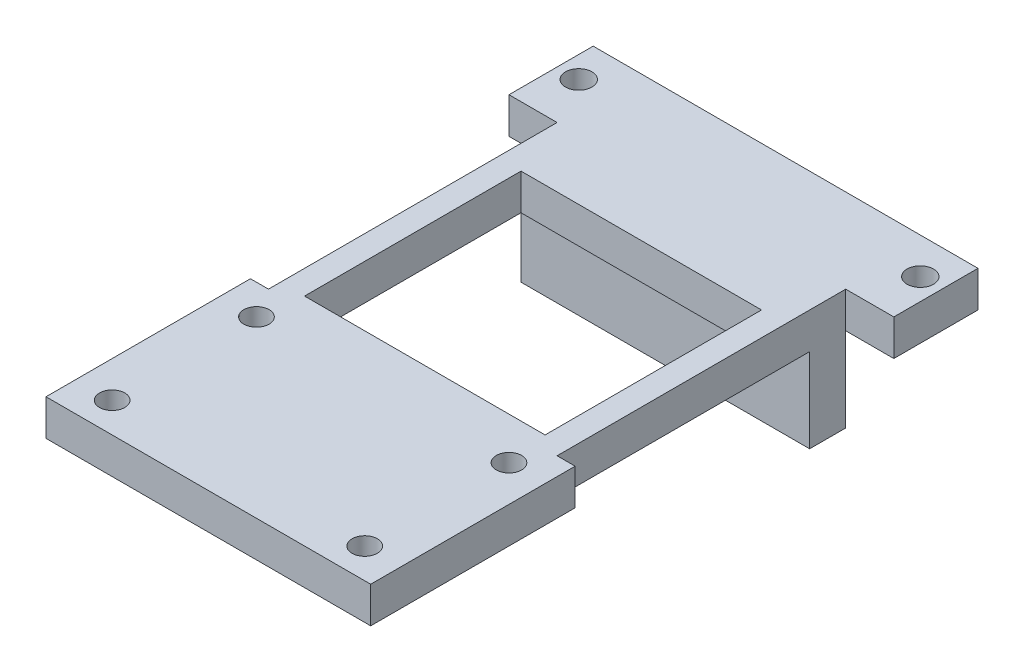
ISO-10303-21;
HEADER;
FILE_DESCRIPTION(('STEP AP214'),'2;1');
FILE_NAME('part.step','',(''),(''),'','','');
FILE_SCHEMA(('AUTOMOTIVE_DESIGN { 1 0 10303 214 1 1 1 1 }'));
ENDSEC;
DATA;
#1=APPLICATION_CONTEXT('core data for automotive mechanical design processes');
#2=APPLICATION_PROTOCOL_DEFINITION('international standard','automotive_design',2000,#1);
#3=PRODUCT_CONTEXT('',#1,'mechanical');
#4=PRODUCT('Part','Part','',(#3));
#5=PRODUCT_RELATED_PRODUCT_CATEGORY('part','',(#4));
#6=PRODUCT_DEFINITION_FORMATION('','',#4);
#7=PRODUCT_DEFINITION_CONTEXT('part definition',#1,'design');
#8=PRODUCT_DEFINITION('design','',#6,#7);
#9=PRODUCT_DEFINITION_SHAPE('','',#8);
#10=(LENGTH_UNIT() NAMED_UNIT(*) SI_UNIT(.MILLI.,.METRE.));
#11=(NAMED_UNIT(*) PLANE_ANGLE_UNIT() SI_UNIT($,.RADIAN.));
#12=(NAMED_UNIT(*) SI_UNIT($,.STERADIAN.) SOLID_ANGLE_UNIT());
#13=UNCERTAINTY_MEASURE_WITH_UNIT(LENGTH_MEASURE(1.E-05),#10,'distance_accuracy_value','');
#14=(GEOMETRIC_REPRESENTATION_CONTEXT(3) GLOBAL_UNCERTAINTY_ASSIGNED_CONTEXT((#13)) GLOBAL_UNIT_ASSIGNED_CONTEXT((#10,
#11,#12)) REPRESENTATION_CONTEXT('',''));
#15=CARTESIAN_POINT('',(0.,0.,0.));
#16=DIRECTION('',(0.,0.,1.));
#17=DIRECTION('',(1.,0.,0.));
#18=AXIS2_PLACEMENT_3D('',#15,#16,#17);
#19=CARTESIAN_POINT('',(22.,7.,-2.99999999999999));
#20=DIRECTION('',(0.,0.,-1.));
#21=DIRECTION('',(-1.,0.,0.));
#22=AXIS2_PLACEMENT_3D('',#19,#20,#21);
#23=PLANE('',#22);
#24=DIRECTION('',(0.,1.,0.));
#25=VECTOR('',#24,1.);
#26=CARTESIAN_POINT('',(-2.,7.,-2.99999999999999));
#27=LINE('',#26,#25);
#28=CARTESIAN_POINT('',(-2.,0.,-2.99999999999999));
#29=VERTEX_POINT('',#28);
#30=CARTESIAN_POINT('',(-2.,7.,-2.99999999999999));
#31=VERTEX_POINT('',#30);
#32=EDGE_CURVE('E277',#29,#31,#27,.T.);
#33=ORIENTED_EDGE('',*,*,#32,.T.);
#34=DIRECTION('',(1.,0.,0.));
#35=VECTOR('',#34,1.);
#36=CARTESIAN_POINT('',(-6.,7.,-2.99999999999999));
#37=LINE('',#36,#35);
#38=CARTESIAN_POINT('',(22.,7.,-2.99999999999999));
#39=VERTEX_POINT('',#38);
#40=EDGE_CURVE('E11',#31,#39,#37,.T.);
#41=ORIENTED_EDGE('',*,*,#40,.T.);
#42=DIRECTION('',(0.,1.,0.));
#43=VECTOR('',#42,1.);
#44=CARTESIAN_POINT('',(22.,7.,-2.99999999999999));
#45=LINE('',#44,#43);
#46=CARTESIAN_POINT('',(22.,0.,-2.99999999999999));
#47=VERTEX_POINT('',#46);
#48=EDGE_CURVE('E281',#47,#39,#45,.T.);
#49=ORIENTED_EDGE('',*,*,#48,.F.);
#50=DIRECTION('',(1.,0.,0.));
#51=VECTOR('',#50,1.);
#52=CARTESIAN_POINT('',(-2.,0.,-2.99999999999999));
#53=LINE('',#52,#51);
#54=EDGE_CURVE('E247',#29,#47,#53,.T.);
#55=ORIENTED_EDGE('',*,*,#54,.F.);
#56=EDGE_LOOP('',(#33,#41,#49,#55));
#57=FACE_BOUND('',#56,.T.);
#58=ADVANCED_FACE('F35',(#57),#23,.T.);
#59=CARTESIAN_POINT('',(0.,7.,21.));
#60=DIRECTION('',(0.,1.,0.));
#61=DIRECTION('',(0.,0.,1.));
#62=AXIS2_PLACEMENT_3D('',#59,#60,#61);
#63=PLANE('',#62);
#64=DIRECTION('',(1.,0.,0.));
#65=VECTOR('',#64,1.);
#66=CARTESIAN_POINT('',(0.,7.,20.));
#67=LINE('',#66,#65);
#68=CARTESIAN_POINT('',(0.,7.,20.));
#69=VERTEX_POINT('',#68);
#70=CARTESIAN_POINT('',(20.,7.,20.));
#71=VERTEX_POINT('',#70);
#72=EDGE_CURVE('E237',#69,#71,#67,.T.);
#73=ORIENTED_EDGE('',*,*,#72,.T.);
#74=DIRECTION('',(0.,0.,-1.));
#75=VECTOR('',#74,1.);
#76=CARTESIAN_POINT('',(20.,7.,21.));
#77=LINE('',#76,#75);
#78=CARTESIAN_POINT('',(20.,7.,2.00000000000001));
#79=VERTEX_POINT('',#78);
#80=EDGE_CURVE('E240',#71,#79,#77,.T.);
#81=ORIENTED_EDGE('',*,*,#80,.T.);
#82=DIRECTION('',(-1.,0.,0.));
#83=VECTOR('',#82,1.);
#84=CARTESIAN_POINT('',(0.,7.,2.00000000000001));
#85=LINE('',#84,#83);
#86=CARTESIAN_POINT('',(0.,7.,2.00000000000001));
#87=VERTEX_POINT('',#86);
#88=EDGE_CURVE('E226',#79,#87,#85,.T.);
#89=ORIENTED_EDGE('',*,*,#88,.T.);
#90=DIRECTION('',(0.,0.,1.));
#91=VECTOR('',#90,1.);
#92=CARTESIAN_POINT('',(0.,7.,21.));
#93=LINE('',#92,#91);
#94=EDGE_CURVE('E234',#87,#69,#93,.T.);
#95=ORIENTED_EDGE('',*,*,#94,.T.);
#96=EDGE_LOOP('',(#73,#81,#89,#95));
#97=FACE_BOUND('',#96,.T.);
#98=CARTESIAN_POINT('',(-0.5,7.,23.5));
#99=DIRECTION('',(0.,-1.,0.));
#100=DIRECTION('',(0.,0.,-1.));
#101=AXIS2_PLACEMENT_3D('',#98,#99,#100);
#102=CIRCLE('',#101,1.05);
#103=CARTESIAN_POINT('',(-0.5,7.,22.45));
#104=VERTEX_POINT('',#103);
#105=EDGE_CURVE('E290',#104,#104,#102,.T.);
#106=ORIENTED_EDGE('',*,*,#105,.F.);
#107=EDGE_LOOP('',(#106));
#108=FACE_BOUND('',#107,.T.);
#109=CARTESIAN_POINT('',(20.5,7.,23.5));
#110=DIRECTION('',(0.,-1.,0.));
#111=DIRECTION('',(0.,0.,-1.));
#112=AXIS2_PLACEMENT_3D('',#109,#110,#111);
#113=CIRCLE('',#112,1.05);
#114=CARTESIAN_POINT('',(20.5,7.,22.45));
#115=VERTEX_POINT('',#114);
#116=EDGE_CURVE('E287',#115,#115,#113,.T.);
#117=ORIENTED_EDGE('',*,*,#116,.F.);
#118=EDGE_LOOP('',(#117));
#119=FACE_BOUND('',#118,.T.);
#120=CARTESIAN_POINT('',(20.5,7.,35.5));
#121=DIRECTION('',(0.,-1.,0.));
#122=DIRECTION('',(0.,0.,-1.));
#123=AXIS2_PLACEMENT_3D('',#120,#121,#122);
#124=CIRCLE('',#123,1.05);
#125=CARTESIAN_POINT('',(20.5,7.,34.45));
#126=VERTEX_POINT('',#125);
#127=EDGE_CURVE('E291',#126,#126,#124,.T.);
#128=ORIENTED_EDGE('',*,*,#127,.F.);
#129=EDGE_LOOP('',(#128));
#130=FACE_BOUND('',#129,.T.);
#131=CARTESIAN_POINT('',(-0.5,7.,35.5));
#132=DIRECTION('',(0.,-1.,0.));
#133=DIRECTION('',(0.,0.,-1.));
#134=AXIS2_PLACEMENT_3D('',#131,#132,#133);
#135=CIRCLE('',#134,1.05);
#136=CARTESIAN_POINT('',(-0.5,7.,34.45));
#137=VERTEX_POINT('',#136);
#138=EDGE_CURVE('E276',#137,#137,#135,.T.);
#139=ORIENTED_EDGE('',*,*,#138,.F.);
#140=EDGE_LOOP('',(#139));
#141=FACE_BOUND('',#140,.T.);
#142=DIRECTION('',(-1.,0.,0.));
#143=VECTOR('',#142,1.);
#144=CARTESIAN_POINT('',(-2.,7.,0.));
#145=LINE('',#144,#143);
#146=CARTESIAN_POINT('',(22.,7.,0.));
#147=VERTEX_POINT('',#146);
#148=CARTESIAN_POINT('',(-2.,7.,0.));
#149=VERTEX_POINT('',#148);
#150=EDGE_CURVE('E243',#147,#149,#145,.T.);
#151=ORIENTED_EDGE('',*,*,#150,.F.);
#152=DIRECTION('',(0.,0.,-1.));
#153=VECTOR('',#152,1.);
#154=CARTESIAN_POINT('',(22.,7.,21.));
#155=LINE('',#154,#153);
#156=CARTESIAN_POINT('',(22.,7.,21.));
#157=VERTEX_POINT('',#156);
#158=EDGE_CURVE('E263',#157,#147,#155,.T.);
#159=ORIENTED_EDGE('',*,*,#158,.F.);
#160=DIRECTION('',(1.,0.,0.));
#161=VECTOR('',#160,1.);
#162=CARTESIAN_POINT('',(0.,7.,21.));
#163=LINE('',#162,#161);
#164=CARTESIAN_POINT('',(23.5,7.,21.));
#165=VERTEX_POINT('',#164);
#166=EDGE_CURVE('E333',#157,#165,#163,.T.);
#167=ORIENTED_EDGE('',*,*,#166,.T.);
#168=DIRECTION('',(0.,0.,1.));
#169=VECTOR('',#168,1.);
#170=CARTESIAN_POINT('',(23.5,7.,38.));
#171=LINE('',#170,#169);
#172=CARTESIAN_POINT('',(23.5,7.,38.));
#173=VERTEX_POINT('',#172);
#174=EDGE_CURVE('E310',#165,#173,#171,.T.);
#175=ORIENTED_EDGE('',*,*,#174,.T.);
#176=DIRECTION('',(-1.,0.,0.));
#177=VECTOR('',#176,1.);
#178=CARTESIAN_POINT('',(-3.5,7.,38.));
#179=LINE('',#178,#177);
#180=CARTESIAN_POINT('',(-3.5,7.,38.));
#181=VERTEX_POINT('',#180);
#182=EDGE_CURVE('E327',#173,#181,#179,.T.);
#183=ORIENTED_EDGE('',*,*,#182,.T.);
#184=DIRECTION('',(0.,0.,-1.));
#185=VECTOR('',#184,1.);
#186=CARTESIAN_POINT('',(-3.5,7.,21.));
#187=LINE('',#186,#185);
#188=CARTESIAN_POINT('',(-3.5,7.,21.));
#189=VERTEX_POINT('',#188);
#190=EDGE_CURVE('E330',#181,#189,#187,.T.);
#191=ORIENTED_EDGE('',*,*,#190,.T.);
#192=CARTESIAN_POINT('',(-2.,7.,21.));
#193=VERTEX_POINT('',#192);
#194=EDGE_CURVE('E334',#189,#193,#163,.T.);
#195=ORIENTED_EDGE('',*,*,#194,.T.);
#196=DIRECTION('',(0.,0.,1.));
#197=VECTOR('',#196,1.);
#198=CARTESIAN_POINT('',(-2.,7.,-2.99999999999999));
#199=LINE('',#198,#197);
#200=EDGE_CURVE('E266',#149,#193,#199,.T.);
#201=ORIENTED_EDGE('',*,*,#200,.F.);
#202=EDGE_LOOP('',(#151,#159,#167,#175,#183,#191,#195,#201));
#203=FACE_BOUND('',#202,.T.);
#204=ADVANCED_FACE('F391',(#97,#108,#119,#130,#141,#203),#63,.F.);
#205=CARTESIAN_POINT('',(0.,10.,21.));
#206=DIRECTION('',(0.,0.,-1.));
#207=DIRECTION('',(-1.,0.,0.));
#208=AXIS2_PLACEMENT_3D('',#205,#206,#207);
#209=PLANE('',#208);
#210=ORIENTED_EDGE('',*,*,#166,.F.);
#211=DIRECTION('',(0.,1.,0.));
#212=VECTOR('',#211,1.);
#213=CARTESIAN_POINT('',(22.,7.,21.));
#214=LINE('',#213,#212);
#215=CARTESIAN_POINT('',(22.,10.,21.));
#216=VERTEX_POINT('',#215);
#217=EDGE_CURVE('E269',#157,#216,#214,.T.);
#218=ORIENTED_EDGE('',*,*,#217,.T.);
#219=DIRECTION('',(1.,0.,0.));
#220=VECTOR('',#219,1.);
#221=CARTESIAN_POINT('',(23.5,10.,21.));
#222=LINE('',#221,#220);
#223=CARTESIAN_POINT('',(23.5,10.,21.));
#224=VERTEX_POINT('',#223);
#225=EDGE_CURVE('E315',#216,#224,#222,.T.);
#226=ORIENTED_EDGE('',*,*,#225,.T.);
#227=DIRECTION('',(0.,-1.,0.));
#228=VECTOR('',#227,1.);
#229=CARTESIAN_POINT('',(23.5,10.,21.));
#230=LINE('',#229,#228);
#231=EDGE_CURVE('E324',#224,#165,#230,.T.);
#232=ORIENTED_EDGE('',*,*,#231,.T.);
#233=EDGE_LOOP('',(#210,#218,#226,#232));
#234=FACE_BOUND('',#233,.T.);
#235=ADVANCED_FACE('F360',(#234),#209,.T.);
#236=CARTESIAN_POINT('',(0.,10.,3.));
#237=DIRECTION('',(0.,-1.,0.));
#238=DIRECTION('',(0.,0.,-1.));
#239=AXIS2_PLACEMENT_3D('',#236,#237,#238);
#240=PLANE('',#239);
#241=CARTESIAN_POINT('',(-4.2,10.,-6.99999999999999));
#242=DIRECTION('',(0.,1.,0.));
#243=DIRECTION('',(0.,0.,1.));
#244=AXIS2_PLACEMENT_3D('',#241,#242,#243);
#245=CIRCLE('',#244,1.1);
#246=CARTESIAN_POINT('',(-4.2,10.,-5.9));
#247=VERTEX_POINT('',#246);
#248=EDGE_CURVE('E345',#247,#247,#245,.T.);
#249=ORIENTED_EDGE('',*,*,#248,.F.);
#250=EDGE_LOOP('',(#249));
#251=FACE_BOUND('',#250,.T.);
#252=CARTESIAN_POINT('',(24.2,10.,-6.99999999999999));
#253=DIRECTION('',(0.,1.,0.));
#254=DIRECTION('',(0.,0.,1.));
#255=AXIS2_PLACEMENT_3D('',#252,#253,#254);
#256=CIRCLE('',#255,1.1);
#257=CARTESIAN_POINT('',(24.2,10.,-5.9));
#258=VERTEX_POINT('',#257);
#259=EDGE_CURVE('E196',#258,#258,#256,.T.);
#260=ORIENTED_EDGE('',*,*,#259,.F.);
#261=EDGE_LOOP('',(#260));
#262=FACE_BOUND('',#261,.T.);
#263=DIRECTION('',(-1.,0.,0.));
#264=VECTOR('',#263,1.);
#265=CARTESIAN_POINT('',(20.,10.,2.00000000000001));
#266=LINE('',#265,#264);
#267=CARTESIAN_POINT('',(20.,10.,2.00000000000001));
#268=VERTEX_POINT('',#267);
#269=CARTESIAN_POINT('',(0.,10.,2.00000000000001));
#270=VERTEX_POINT('',#269);
#271=EDGE_CURVE('E215',#268,#270,#266,.T.);
#272=ORIENTED_EDGE('',*,*,#271,.F.);
#273=DIRECTION('',(0.,0.,-1.));
#274=VECTOR('',#273,1.);
#275=CARTESIAN_POINT('',(20.,10.,20.));
#276=LINE('',#275,#274);
#277=CARTESIAN_POINT('',(20.,10.,20.));
#278=VERTEX_POINT('',#277);
#279=EDGE_CURVE('E209',#278,#268,#276,.T.);
#280=ORIENTED_EDGE('',*,*,#279,.F.);
#281=DIRECTION('',(1.,0.,0.));
#282=VECTOR('',#281,1.);
#283=CARTESIAN_POINT('',(20.,10.,20.));
#284=LINE('',#283,#282);
#285=CARTESIAN_POINT('',(0.,10.,20.));
#286=VERTEX_POINT('',#285);
#287=EDGE_CURVE('E220',#286,#278,#284,.T.);
#288=ORIENTED_EDGE('',*,*,#287,.F.);
#289=DIRECTION('',(0.,0.,1.));
#290=VECTOR('',#289,1.);
#291=CARTESIAN_POINT('',(0.,10.,20.));
#292=LINE('',#291,#290);
#293=EDGE_CURVE('E217',#270,#286,#292,.T.);
#294=ORIENTED_EDGE('',*,*,#293,.F.);
#295=EDGE_LOOP('',(#272,#280,#288,#294));
#296=FACE_BOUND('',#295,.T.);
#297=CARTESIAN_POINT('',(-0.5,10.,35.5));
#298=DIRECTION('',(0.,-1.,0.));
#299=DIRECTION('',(0.,0.,-1.));
#300=AXIS2_PLACEMENT_3D('',#297,#298,#299);
#301=CIRCLE('',#300,1.05);
#302=CARTESIAN_POINT('',(-0.5,10.,34.45));
#303=VERTEX_POINT('',#302);
#304=EDGE_CURVE('E307',#303,#303,#301,.T.);
#305=ORIENTED_EDGE('',*,*,#304,.T.);
#306=EDGE_LOOP('',(#305));
#307=FACE_BOUND('',#306,.T.);
#308=CARTESIAN_POINT('',(20.5,10.,35.5));
#309=DIRECTION('',(0.,-1.,0.));
#310=DIRECTION('',(0.,0.,-1.));
#311=AXIS2_PLACEMENT_3D('',#308,#309,#310);
#312=CIRCLE('',#311,1.05);
#313=CARTESIAN_POINT('',(20.5,10.,34.45));
#314=VERTEX_POINT('',#313);
#315=EDGE_CURVE('E304',#314,#314,#312,.T.);
#316=ORIENTED_EDGE('',*,*,#315,.T.);
#317=EDGE_LOOP('',(#316));
#318=FACE_BOUND('',#317,.T.);
#319=CARTESIAN_POINT('',(20.5,10.,23.5));
#320=DIRECTION('',(0.,-1.,0.));
#321=DIRECTION('',(0.,0.,-1.));
#322=AXIS2_PLACEMENT_3D('',#319,#320,#321);
#323=CIRCLE('',#322,1.05);
#324=CARTESIAN_POINT('',(20.5,10.,22.45));
#325=VERTEX_POINT('',#324);
#326=EDGE_CURVE('E301',#325,#325,#323,.T.);
#327=ORIENTED_EDGE('',*,*,#326,.T.);
#328=EDGE_LOOP('',(#327));
#329=FACE_BOUND('',#328,.T.);
#330=CARTESIAN_POINT('',(-0.5,10.,23.5));
#331=DIRECTION('',(0.,-1.,0.));
#332=DIRECTION('',(0.,0.,-1.));
#333=AXIS2_PLACEMENT_3D('',#330,#331,#332);
#334=CIRCLE('',#333,1.05);
#335=CARTESIAN_POINT('',(-0.5,10.,22.45));
#336=VERTEX_POINT('',#335);
#337=EDGE_CURVE('E298',#336,#336,#334,.T.);
#338=ORIENTED_EDGE('',*,*,#337,.T.);
#339=EDGE_LOOP('',(#338));
#340=FACE_BOUND('',#339,.T.);
#341=DIRECTION('',(0.,0.,1.));
#342=VECTOR('',#341,1.);
#343=CARTESIAN_POINT('',(23.5,10.,38.));
#344=LINE('',#343,#342);
#345=CARTESIAN_POINT('',(23.5,10.,38.));
#346=VERTEX_POINT('',#345);
#347=EDGE_CURVE('E314',#224,#346,#344,.T.);
#348=ORIENTED_EDGE('',*,*,#347,.F.);
#349=ORIENTED_EDGE('',*,*,#225,.F.);
#350=DIRECTION('',(0.,0.,-1.));
#351=VECTOR('',#350,1.);
#352=CARTESIAN_POINT('',(22.,10.,21.));
#353=LINE('',#352,#351);
#354=CARTESIAN_POINT('',(22.,10.,-2.99999999999999));
#355=VERTEX_POINT('',#354);
#356=EDGE_CURVE('E262',#216,#355,#353,.T.);
#357=ORIENTED_EDGE('',*,*,#356,.T.);
#358=DIRECTION('',(1.,0.,0.));
#359=VECTOR('',#358,1.);
#360=CARTESIAN_POINT('',(-6.,10.,-2.99999999999999));
#361=LINE('',#360,#359);
#362=CARTESIAN_POINT('',(26.,10.,-2.99999999999999));
#363=VERTEX_POINT('',#362);
#364=EDGE_CURVE('E204',#355,#363,#361,.T.);
#365=ORIENTED_EDGE('',*,*,#364,.T.);
#366=DIRECTION('',(0.,0.,-1.));
#367=VECTOR('',#366,1.);
#368=CARTESIAN_POINT('',(26.,10.,-2.99999999999999));
#369=LINE('',#368,#367);
#370=CARTESIAN_POINT('',(26.,10.,-9.99999999999999));
#371=VERTEX_POINT('',#370);
#372=EDGE_CURVE('E193',#363,#371,#369,.T.);
#373=ORIENTED_EDGE('',*,*,#372,.T.);
#374=DIRECTION('',(-1.,0.,0.));
#375=VECTOR('',#374,1.);
#376=CARTESIAN_POINT('',(-6.,10.,-9.99999999999999));
#377=LINE('',#376,#375);
#378=CARTESIAN_POINT('',(-6.,10.,-9.99999999999999));
#379=VERTEX_POINT('',#378);
#380=EDGE_CURVE('E190',#371,#379,#377,.T.);
#381=ORIENTED_EDGE('',*,*,#380,.T.);
#382=DIRECTION('',(0.,0.,1.));
#383=VECTOR('',#382,1.);
#384=CARTESIAN_POINT('',(-6.,10.,-2.99999999999999));
#385=LINE('',#384,#383);
#386=CARTESIAN_POINT('',(-6.,10.,-2.99999999999999));
#387=VERTEX_POINT('',#386);
#388=EDGE_CURVE('E202',#379,#387,#385,.T.);
#389=ORIENTED_EDGE('',*,*,#388,.T.);
#390=CARTESIAN_POINT('',(-2.,10.,-2.99999999999999));
#391=VERTEX_POINT('',#390);
#392=EDGE_CURVE('E174',#387,#391,#361,.T.);
#393=ORIENTED_EDGE('',*,*,#392,.T.);
#394=DIRECTION('',(0.,0.,1.));
#395=VECTOR('',#394,1.);
#396=CARTESIAN_POINT('',(-2.,10.,-2.99999999999999));
#397=LINE('',#396,#395);
#398=CARTESIAN_POINT('',(-2.,10.,21.));
#399=VERTEX_POINT('',#398);
#400=EDGE_CURVE('E267',#391,#399,#397,.T.);
#401=ORIENTED_EDGE('',*,*,#400,.T.);
#402=CARTESIAN_POINT('',(-3.5,10.,21.));
#403=VERTEX_POINT('',#402);
#404=EDGE_CURVE('E311',#403,#399,#222,.T.);
#405=ORIENTED_EDGE('',*,*,#404,.F.);
#406=DIRECTION('',(0.,0.,-1.));
#407=VECTOR('',#406,1.);
#408=CARTESIAN_POINT('',(-3.5,10.,21.));
#409=LINE('',#408,#407);
#410=CARTESIAN_POINT('',(-3.5,10.,38.));
#411=VERTEX_POINT('',#410);
#412=EDGE_CURVE('E321',#411,#403,#409,.T.);
#413=ORIENTED_EDGE('',*,*,#412,.F.);
#414=DIRECTION('',(-1.,0.,0.));
#415=VECTOR('',#414,1.);
#416=CARTESIAN_POINT('',(-3.5,10.,38.));
#417=LINE('',#416,#415);
#418=EDGE_CURVE('E318',#346,#411,#417,.T.);
#419=ORIENTED_EDGE('',*,*,#418,.F.);
#420=EDGE_LOOP('',(#348,#349,#357,#365,#373,#381,#389,#393,#401,#405,#413,#419));
#421=FACE_BOUND('',#420,.T.);
#422=ADVANCED_FACE('F37',(#251,#262,#296,#307,#318,#329,#340,#421),#240,.F.);
#423=DIRECTION('',(0.,1.,0.));
#424=VECTOR('',#423,1.);
#425=CARTESIAN_POINT('',(-2.,7.,21.));
#426=LINE('',#425,#424);
#427=EDGE_CURVE('E274',#193,#399,#426,.T.);
#428=ORIENTED_EDGE('',*,*,#427,.F.);
#429=ORIENTED_EDGE('',*,*,#194,.F.);
#430=DIRECTION('',(0.,-1.,0.));
#431=VECTOR('',#430,1.);
#432=CARTESIAN_POINT('',(-3.5,10.,21.));
#433=LINE('',#432,#431);
#434=EDGE_CURVE('E44',#403,#189,#433,.T.);
#435=ORIENTED_EDGE('',*,*,#434,.F.);
#436=ORIENTED_EDGE('',*,*,#404,.T.);
#437=EDGE_LOOP('',(#428,#429,#435,#436));
#438=FACE_BOUND('',#437,.T.);
#439=ADVANCED_FACE('F359',(#438),#209,.T.);
#440=CARTESIAN_POINT('',(-3.5,10.,21.));
#441=DIRECTION('',(-1.,0.,0.));
#442=DIRECTION('',(0.,0.,1.));
#443=AXIS2_PLACEMENT_3D('',#440,#441,#442);
#444=PLANE('',#443);
#445=ORIENTED_EDGE('',*,*,#190,.F.);
#446=DIRECTION('',(0.,-1.,0.));
#447=VECTOR('',#446,1.);
#448=CARTESIAN_POINT('',(-3.5,10.,38.));
#449=LINE('',#448,#447);
#450=EDGE_CURVE('E338',#411,#181,#449,.T.);
#451=ORIENTED_EDGE('',*,*,#450,.F.);
#452=ORIENTED_EDGE('',*,*,#412,.T.);
#453=ORIENTED_EDGE('',*,*,#434,.T.);
#454=EDGE_LOOP('',(#445,#451,#452,#453));
#455=FACE_BOUND('',#454,.T.);
#456=ADVANCED_FACE('F437',(#455),#444,.T.);
#457=CARTESIAN_POINT('',(-3.5,10.,38.));
#458=DIRECTION('',(0.,0.,1.));
#459=DIRECTION('',(1.,0.,0.));
#460=AXIS2_PLACEMENT_3D('',#457,#458,#459);
#461=PLANE('',#460);
#462=ORIENTED_EDGE('',*,*,#182,.F.);
#463=DIRECTION('',(0.,-1.,0.));
#464=VECTOR('',#463,1.);
#465=CARTESIAN_POINT('',(23.5,10.,38.));
#466=LINE('',#465,#464);
#467=EDGE_CURVE('E340',#346,#173,#466,.T.);
#468=ORIENTED_EDGE('',*,*,#467,.F.);
#469=ORIENTED_EDGE('',*,*,#418,.T.);
#470=ORIENTED_EDGE('',*,*,#450,.T.);
#471=EDGE_LOOP('',(#462,#468,#469,#470));
#472=FACE_BOUND('',#471,.T.);
#473=ADVANCED_FACE('F441',(#472),#461,.T.);
#474=CARTESIAN_POINT('',(23.5,10.,38.));
#475=DIRECTION('',(1.,0.,0.));
#476=DIRECTION('',(0.,0.,-1.));
#477=AXIS2_PLACEMENT_3D('',#474,#475,#476);
#478=PLANE('',#477);
#479=ORIENTED_EDGE('',*,*,#174,.F.);
#480=ORIENTED_EDGE('',*,*,#231,.F.);
#481=ORIENTED_EDGE('',*,*,#347,.T.);
#482=ORIENTED_EDGE('',*,*,#467,.T.);
#483=EDGE_LOOP('',(#479,#480,#481,#482));
#484=FACE_BOUND('',#483,.T.);
#485=ADVANCED_FACE('F381',(#484),#478,.T.);
#486=CARTESIAN_POINT('',(-0.5,17.,23.5));
#487=DIRECTION('',(0.,-1.,0.));
#488=DIRECTION('',(0.,0.,-1.));
#489=AXIS2_PLACEMENT_3D('',#486,#487,#488);
#490=CYLINDRICAL_SURFACE('',#489,1.05);
#491=ORIENTED_EDGE('',*,*,#105,.T.);
#492=EDGE_LOOP('',(#491));
#493=FACE_BOUND('',#492,.T.);
#494=ORIENTED_EDGE('',*,*,#337,.F.);
#495=EDGE_LOOP('',(#494));
#496=FACE_BOUND('',#495,.T.);
#497=ADVANCED_FACE('F423',(#493,#496),#490,.F.);
#498=CARTESIAN_POINT('',(20.5,17.,23.5));
#499=DIRECTION('',(0.,-1.,0.));
#500=DIRECTION('',(0.,0.,-1.));
#501=AXIS2_PLACEMENT_3D('',#498,#499,#500);
#502=CYLINDRICAL_SURFACE('',#501,1.05);
#503=ORIENTED_EDGE('',*,*,#116,.T.);
#504=EDGE_LOOP('',(#503));
#505=FACE_BOUND('',#504,.T.);
#506=ORIENTED_EDGE('',*,*,#326,.F.);
#507=EDGE_LOOP('',(#506));
#508=FACE_BOUND('',#507,.T.);
#509=ADVANCED_FACE('F419',(#505,#508),#502,.F.);
#510=CARTESIAN_POINT('',(20.5,17.,35.5));
#511=DIRECTION('',(0.,-1.,0.));
#512=DIRECTION('',(0.,0.,-1.));
#513=AXIS2_PLACEMENT_3D('',#510,#511,#512);
#514=CYLINDRICAL_SURFACE('',#513,1.05);
#515=ORIENTED_EDGE('',*,*,#127,.T.);
#516=EDGE_LOOP('',(#515));
#517=FACE_BOUND('',#516,.T.);
#518=ORIENTED_EDGE('',*,*,#315,.F.);
#519=EDGE_LOOP('',(#518));
#520=FACE_BOUND('',#519,.T.);
#521=ADVANCED_FACE('F422',(#517,#520),#514,.F.);
#522=CARTESIAN_POINT('',(-0.5,17.,35.5));
#523=DIRECTION('',(0.,-1.,0.));
#524=DIRECTION('',(0.,0.,-1.));
#525=AXIS2_PLACEMENT_3D('',#522,#523,#524);
#526=CYLINDRICAL_SURFACE('',#525,1.05);
#527=ORIENTED_EDGE('',*,*,#138,.T.);
#528=EDGE_LOOP('',(#527));
#529=FACE_BOUND('',#528,.T.);
#530=ORIENTED_EDGE('',*,*,#304,.F.);
#531=EDGE_LOOP('',(#530));
#532=FACE_BOUND('',#531,.T.);
#533=ADVANCED_FACE('F427',(#529,#532),#526,.F.);
#534=CARTESIAN_POINT('',(-2.,7.,-2.99999999999999));
#535=DIRECTION('',(-1.,0.,0.));
#536=DIRECTION('',(0.,0.,1.));
#537=AXIS2_PLACEMENT_3D('',#534,#535,#536);
#538=PLANE('',#537);
#539=ORIENTED_EDGE('',*,*,#400,.F.);
#540=EDGE_CURVE('E280',#31,#391,#27,.T.);
#541=ORIENTED_EDGE('',*,*,#540,.F.);
#542=ORIENTED_EDGE('',*,*,#32,.F.);
#543=DIRECTION('',(0.,0.,-1.));
#544=VECTOR('',#543,1.);
#545=CARTESIAN_POINT('',(-2.,0.,-2.99999999999999));
#546=LINE('',#545,#544);
#547=CARTESIAN_POINT('',(-2.,0.,0.));
#548=VERTEX_POINT('',#547);
#549=EDGE_CURVE('E244',#548,#29,#546,.T.);
#550=ORIENTED_EDGE('',*,*,#549,.F.);
#551=DIRECTION('',(0.,1.,0.));
#552=VECTOR('',#551,1.);
#553=CARTESIAN_POINT('',(-2.,0.,0.));
#554=LINE('',#553,#552);
#555=EDGE_CURVE('E254',#548,#149,#554,.T.);
#556=ORIENTED_EDGE('',*,*,#555,.T.);
#557=ORIENTED_EDGE('',*,*,#200,.T.);
#558=ORIENTED_EDGE('',*,*,#427,.T.);
#559=EDGE_LOOP('',(#539,#541,#542,#550,#556,#557,#558));
#560=FACE_BOUND('',#559,.T.);
#561=ADVANCED_FACE('F399',(#560),#538,.T.);
#562=CARTESIAN_POINT('',(22.,7.,21.));
#563=DIRECTION('',(1.,0.,0.));
#564=DIRECTION('',(0.,0.,-1.));
#565=AXIS2_PLACEMENT_3D('',#562,#563,#564);
#566=PLANE('',#565);
#567=ORIENTED_EDGE('',*,*,#356,.F.);
#568=ORIENTED_EDGE('',*,*,#217,.F.);
#569=ORIENTED_EDGE('',*,*,#158,.T.);
#570=DIRECTION('',(0.,1.,0.));
#571=VECTOR('',#570,1.);
#572=CARTESIAN_POINT('',(22.,0.,0.));
#573=LINE('',#572,#571);
#574=CARTESIAN_POINT('',(22.,0.,0.));
#575=VERTEX_POINT('',#574);
#576=EDGE_CURVE('E259',#575,#147,#573,.T.);
#577=ORIENTED_EDGE('',*,*,#576,.F.);
#578=DIRECTION('',(0.,0.,1.));
#579=VECTOR('',#578,1.);
#580=CARTESIAN_POINT('',(22.,0.,-2.99999999999999));
#581=LINE('',#580,#579);
#582=EDGE_CURVE('E250',#47,#575,#581,.T.);
#583=ORIENTED_EDGE('',*,*,#582,.F.);
#584=ORIENTED_EDGE('',*,*,#48,.T.);
#585=EDGE_CURVE('E284',#39,#355,#45,.T.);
#586=ORIENTED_EDGE('',*,*,#585,.T.);
#587=EDGE_LOOP('',(#567,#568,#569,#577,#583,#584,#586));
#588=FACE_BOUND('',#587,.T.);
#589=ADVANCED_FACE('F387',(#588),#566,.T.);
#590=CARTESIAN_POINT('',(-2.,0.,0.));
#591=DIRECTION('',(0.,0.,-1.));
#592=DIRECTION('',(-1.,0.,0.));
#593=AXIS2_PLACEMENT_3D('',#590,#591,#592);
#594=PLANE('',#593);
#595=ORIENTED_EDGE('',*,*,#150,.T.);
#596=ORIENTED_EDGE('',*,*,#555,.F.);
#597=DIRECTION('',(-1.,0.,0.));
#598=VECTOR('',#597,1.);
#599=CARTESIAN_POINT('',(-2.,0.,0.));
#600=LINE('',#599,#598);
#601=EDGE_CURVE('E252',#575,#548,#600,.T.);
#602=ORIENTED_EDGE('',*,*,#601,.F.);
#603=ORIENTED_EDGE('',*,*,#576,.T.);
#604=EDGE_LOOP('',(#595,#596,#602,#603));
#605=FACE_BOUND('',#604,.T.);
#606=ADVANCED_FACE('F394',(#605),#594,.F.);
#607=CARTESIAN_POINT('',(0.,0.,0.));
#608=DIRECTION('',(0.,1.,0.));
#609=DIRECTION('',(0.,0.,1.));
#610=AXIS2_PLACEMENT_3D('',#607,#608,#609);
#611=PLANE('',#610);
#612=ORIENTED_EDGE('',*,*,#549,.T.);
#613=ORIENTED_EDGE('',*,*,#54,.T.);
#614=ORIENTED_EDGE('',*,*,#582,.T.);
#615=ORIENTED_EDGE('',*,*,#601,.T.);
#616=EDGE_LOOP('',(#612,#613,#614,#615));
#617=FACE_BOUND('',#616,.T.);
#618=ADVANCED_FACE('F403',(#617),#611,.F.);
#619=CARTESIAN_POINT('',(20.,3.,20.));
#620=DIRECTION('',(1.,0.,0.));
#621=DIRECTION('',(0.,0.,-1.));
#622=AXIS2_PLACEMENT_3D('',#619,#620,#621);
#623=PLANE('',#622);
#624=DIRECTION('',(0.,1.,0.));
#625=VECTOR('',#624,1.);
#626=CARTESIAN_POINT('',(20.,3.,20.));
#627=LINE('',#626,#625);
#628=EDGE_CURVE('E224',#71,#278,#627,.T.);
#629=ORIENTED_EDGE('',*,*,#628,.T.);
#630=ORIENTED_EDGE('',*,*,#279,.T.);
#631=DIRECTION('',(0.,1.,0.));
#632=VECTOR('',#631,1.);
#633=CARTESIAN_POINT('',(20.,3.,2.00000000000001));
#634=LINE('',#633,#632);
#635=EDGE_CURVE('E223',#79,#268,#634,.T.);
#636=ORIENTED_EDGE('',*,*,#635,.F.);
#637=ORIENTED_EDGE('',*,*,#80,.F.);
#638=EDGE_LOOP('',(#629,#630,#636,#637));
#639=FACE_BOUND('',#638,.T.);
#640=ADVANCED_FACE('F507',(#639),#623,.F.);
#641=CARTESIAN_POINT('',(20.,3.,20.));
#642=DIRECTION('',(0.,0.,1.));
#643=DIRECTION('',(1.,0.,0.));
#644=AXIS2_PLACEMENT_3D('',#641,#642,#643);
#645=PLANE('',#644);
#646=DIRECTION('',(0.,1.,0.));
#647=VECTOR('',#646,1.);
#648=CARTESIAN_POINT('',(0.,3.,20.));
#649=LINE('',#648,#647);
#650=EDGE_CURVE('E227',#69,#286,#649,.T.);
#651=ORIENTED_EDGE('',*,*,#650,.T.);
#652=ORIENTED_EDGE('',*,*,#287,.T.);
#653=ORIENTED_EDGE('',*,*,#628,.F.);
#654=ORIENTED_EDGE('',*,*,#72,.F.);
#655=EDGE_LOOP('',(#651,#652,#653,#654));
#656=FACE_BOUND('',#655,.T.);
#657=ADVANCED_FACE('F513',(#656),#645,.F.);
#658=CARTESIAN_POINT('',(0.,3.,20.));
#659=DIRECTION('',(-1.,0.,0.));
#660=DIRECTION('',(0.,0.,1.));
#661=AXIS2_PLACEMENT_3D('',#658,#659,#660);
#662=PLANE('',#661);
#663=DIRECTION('',(0.,1.,0.));
#664=VECTOR('',#663,1.);
#665=CARTESIAN_POINT('',(0.,3.,2.00000000000001));
#666=LINE('',#665,#664);
#667=EDGE_CURVE('E61',#87,#270,#666,.T.);
#668=ORIENTED_EDGE('',*,*,#667,.T.);
#669=ORIENTED_EDGE('',*,*,#293,.T.);
#670=ORIENTED_EDGE('',*,*,#650,.F.);
#671=ORIENTED_EDGE('',*,*,#94,.F.);
#672=EDGE_LOOP('',(#668,#669,#670,#671));
#673=FACE_BOUND('',#672,.T.);
#674=ADVANCED_FACE('F521',(#673),#662,.F.);
#675=CARTESIAN_POINT('',(20.,3.,2.00000000000001));
#676=DIRECTION('',(0.,0.,-1.));
#677=DIRECTION('',(-1.,0.,0.));
#678=AXIS2_PLACEMENT_3D('',#675,#676,#677);
#679=PLANE('',#678);
#680=ORIENTED_EDGE('',*,*,#635,.T.);
#681=ORIENTED_EDGE('',*,*,#271,.T.);
#682=ORIENTED_EDGE('',*,*,#667,.F.);
#683=ORIENTED_EDGE('',*,*,#88,.F.);
#684=EDGE_LOOP('',(#680,#681,#682,#683));
#685=FACE_BOUND('',#684,.T.);
#686=ADVANCED_FACE('F529',(#685),#679,.F.);
#687=CARTESIAN_POINT('',(-6.,7.,-2.99999999999999));
#688=DIRECTION('',(0.,0.,1.));
#689=DIRECTION('',(1.,0.,0.));
#690=AXIS2_PLACEMENT_3D('',#687,#688,#689);
#691=PLANE('',#690);
#692=ORIENTED_EDGE('',*,*,#585,.F.);
#693=CARTESIAN_POINT('',(26.,7.,-2.99999999999999));
#694=VERTEX_POINT('',#693);
#695=EDGE_CURVE('E47',#39,#694,#37,.T.);
#696=ORIENTED_EDGE('',*,*,#695,.T.);
#697=DIRECTION('',(0.,1.,0.));
#698=VECTOR('',#697,1.);
#699=CARTESIAN_POINT('',(26.,7.,-2.99999999999999));
#700=LINE('',#699,#698);
#701=EDGE_CURVE('E179',#694,#363,#700,.T.);
#702=ORIENTED_EDGE('',*,*,#701,.T.);
#703=ORIENTED_EDGE('',*,*,#364,.F.);
#704=EDGE_LOOP('',(#692,#696,#702,#703));
#705=FACE_BOUND('',#704,.T.);
#706=ADVANCED_FACE('F536',(#705),#691,.T.);
#707=CARTESIAN_POINT('',(-6.,7.,-2.99999999999999));
#708=DIRECTION('',(-1.,0.,0.));
#709=DIRECTION('',(0.,0.,1.));
#710=AXIS2_PLACEMENT_3D('',#707,#708,#709);
#711=PLANE('',#710);
#712=ORIENTED_EDGE('',*,*,#388,.F.);
#713=DIRECTION('',(0.,1.,0.));
#714=VECTOR('',#713,1.);
#715=CARTESIAN_POINT('',(-6.,7.,-9.99999999999999));
#716=LINE('',#715,#714);
#717=CARTESIAN_POINT('',(-6.,7.,-9.99999999999999));
#718=VERTEX_POINT('',#717);
#719=EDGE_CURVE('E189',#718,#379,#716,.T.);
#720=ORIENTED_EDGE('',*,*,#719,.F.);
#721=DIRECTION('',(0.,0.,1.));
#722=VECTOR('',#721,1.);
#723=CARTESIAN_POINT('',(-6.,7.,-2.99999999999999));
#724=LINE('',#723,#722);
#725=CARTESIAN_POINT('',(-6.,7.,-2.99999999999999));
#726=VERTEX_POINT('',#725);
#727=EDGE_CURVE('E185',#718,#726,#724,.T.);
#728=ORIENTED_EDGE('',*,*,#727,.T.);
#729=DIRECTION('',(0.,1.,0.));
#730=VECTOR('',#729,1.);
#731=CARTESIAN_POINT('',(-6.,7.,-2.99999999999999));
#732=LINE('',#731,#730);
#733=EDGE_CURVE('E169',#726,#387,#732,.T.);
#734=ORIENTED_EDGE('',*,*,#733,.T.);
#735=EDGE_LOOP('',(#712,#720,#728,#734));
#736=FACE_BOUND('',#735,.T.);
#737=ADVANCED_FACE('F188',(#736),#711,.T.);
#738=CARTESIAN_POINT('',(-6.,7.,-9.99999999999999));
#739=DIRECTION('',(0.,0.,-1.));
#740=DIRECTION('',(-1.,0.,0.));
#741=AXIS2_PLACEMENT_3D('',#738,#739,#740);
#742=PLANE('',#741);
#743=ORIENTED_EDGE('',*,*,#380,.F.);
#744=DIRECTION('',(0.,1.,0.));
#745=VECTOR('',#744,1.);
#746=CARTESIAN_POINT('',(26.,7.,-9.99999999999999));
#747=LINE('',#746,#745);
#748=CARTESIAN_POINT('',(26.,7.,-9.99999999999999));
#749=VERTEX_POINT('',#748);
#750=EDGE_CURVE('E210',#749,#371,#747,.T.);
#751=ORIENTED_EDGE('',*,*,#750,.F.);
#752=DIRECTION('',(-1.,0.,0.));
#753=VECTOR('',#752,1.);
#754=CARTESIAN_POINT('',(-6.,7.,-9.99999999999999));
#755=LINE('',#754,#753);
#756=EDGE_CURVE('E180',#749,#718,#755,.T.);
#757=ORIENTED_EDGE('',*,*,#756,.T.);
#758=ORIENTED_EDGE('',*,*,#719,.T.);
#759=EDGE_LOOP('',(#743,#751,#757,#758));
#760=FACE_BOUND('',#759,.T.);
#761=ADVANCED_FACE('F560',(#760),#742,.T.);
#762=CARTESIAN_POINT('',(26.,7.,-2.99999999999999));
#763=DIRECTION('',(1.,0.,0.));
#764=DIRECTION('',(0.,0.,-1.));
#765=AXIS2_PLACEMENT_3D('',#762,#763,#764);
#766=PLANE('',#765);
#767=ORIENTED_EDGE('',*,*,#372,.F.);
#768=ORIENTED_EDGE('',*,*,#701,.F.);
#769=DIRECTION('',(0.,0.,-1.));
#770=VECTOR('',#769,1.);
#771=CARTESIAN_POINT('',(26.,7.,-2.99999999999999));
#772=LINE('',#771,#770);
#773=EDGE_CURVE('E187',#694,#749,#772,.T.);
#774=ORIENTED_EDGE('',*,*,#773,.T.);
#775=ORIENTED_EDGE('',*,*,#750,.T.);
#776=EDGE_LOOP('',(#767,#768,#774,#775));
#777=FACE_BOUND('',#776,.T.);
#778=ADVANCED_FACE('F567',(#777),#766,.T.);
#779=EDGE_CURVE('E46',#726,#31,#37,.T.);
#780=ORIENTED_EDGE('',*,*,#779,.T.);
#781=ORIENTED_EDGE('',*,*,#540,.T.);
#782=ORIENTED_EDGE('',*,*,#392,.F.);
#783=ORIENTED_EDGE('',*,*,#733,.F.);
#784=EDGE_LOOP('',(#780,#781,#782,#783));
#785=FACE_BOUND('',#784,.T.);
#786=ADVANCED_FACE('F171',(#785),#691,.T.);
#787=CARTESIAN_POINT('',(0.,7.,0.));
#788=DIRECTION('',(0.,-1.,0.));
#789=DIRECTION('',(0.,0.,-1.));
#790=AXIS2_PLACEMENT_3D('',#787,#788,#789);
#791=PLANE('',#790);
#792=CARTESIAN_POINT('',(-4.2,7.,-6.99999999999999));
#793=DIRECTION('',(0.,-1.,0.));
#794=DIRECTION('',(0.,0.,-1.));
#795=AXIS2_PLACEMENT_3D('',#792,#793,#794);
#796=CIRCLE('',#795,1.1);
#797=CARTESIAN_POINT('',(-4.2,7.,-8.09999999999999));
#798=VERTEX_POINT('',#797);
#799=EDGE_CURVE('E39',#798,#798,#796,.T.);
#800=ORIENTED_EDGE('',*,*,#799,.F.);
#801=EDGE_LOOP('',(#800));
#802=FACE_BOUND('',#801,.T.);
#803=CARTESIAN_POINT('',(24.2,7.,-6.99999999999999));
#804=DIRECTION('',(0.,-1.,0.));
#805=DIRECTION('',(0.,0.,-1.));
#806=AXIS2_PLACEMENT_3D('',#803,#804,#805);
#807=CIRCLE('',#806,1.1);
#808=CARTESIAN_POINT('',(24.2,7.,-8.09999999999999));
#809=VERTEX_POINT('',#808);
#810=EDGE_CURVE('E343',#809,#809,#807,.T.);
#811=ORIENTED_EDGE('',*,*,#810,.F.);
#812=EDGE_LOOP('',(#811));
#813=FACE_BOUND('',#812,.T.);
#814=ORIENTED_EDGE('',*,*,#727,.F.);
#815=ORIENTED_EDGE('',*,*,#756,.F.);
#816=ORIENTED_EDGE('',*,*,#773,.F.);
#817=ORIENTED_EDGE('',*,*,#695,.F.);
#818=ORIENTED_EDGE('',*,*,#40,.F.);
#819=ORIENTED_EDGE('',*,*,#779,.F.);
#820=EDGE_LOOP('',(#814,#815,#816,#817,#818,#819));
#821=FACE_BOUND('',#820,.T.);
#822=ADVANCED_FACE('F183',(#802,#813,#821),#791,.T.);
#823=CARTESIAN_POINT('',(24.2,6.,-6.99999999999999));
#824=DIRECTION('',(0.,1.,0.));
#825=DIRECTION('',(0.,0.,1.));
#826=AXIS2_PLACEMENT_3D('',#823,#824,#825);
#827=CYLINDRICAL_SURFACE('',#826,1.1);
#828=ORIENTED_EDGE('',*,*,#810,.T.);
#829=EDGE_LOOP('',(#828));
#830=FACE_BOUND('',#829,.T.);
#831=ORIENTED_EDGE('',*,*,#259,.T.);
#832=EDGE_LOOP('',(#831));
#833=FACE_BOUND('',#832,.T.);
#834=ADVANCED_FACE('F355',(#830,#833),#827,.F.);
#835=CARTESIAN_POINT('',(-4.2,6.,-6.99999999999999));
#836=DIRECTION('',(0.,1.,0.));
#837=DIRECTION('',(0.,0.,1.));
#838=AXIS2_PLACEMENT_3D('',#835,#836,#837);
#839=CYLINDRICAL_SURFACE('',#838,1.1);
#840=ORIENTED_EDGE('',*,*,#799,.T.);
#841=EDGE_LOOP('',(#840));
#842=FACE_BOUND('',#841,.T.);
#843=ORIENTED_EDGE('',*,*,#248,.T.);
#844=EDGE_LOOP('',(#843));
#845=FACE_BOUND('',#844,.T.);
#846=ADVANCED_FACE('F592',(#842,#845),#839,.F.);
#847=CLOSED_SHELL('',(#58,#204,#235,#422,#439,#456,#473,#485,#497,#509,#521,#533,#561,#589,#606,
#618,#640,#657,#674,#686,#706,#737,#761,#778,#786,#822,#834,#846));
#848=MANIFOLD_SOLID_BREP('B2',#847);
#849=ADVANCED_BREP_SHAPE_REPRESENTATION('',(#18,#848),#14);
#850=SHAPE_DEFINITION_REPRESENTATION(#9,#849);
ENDSEC;
END-ISO-10303-21;
